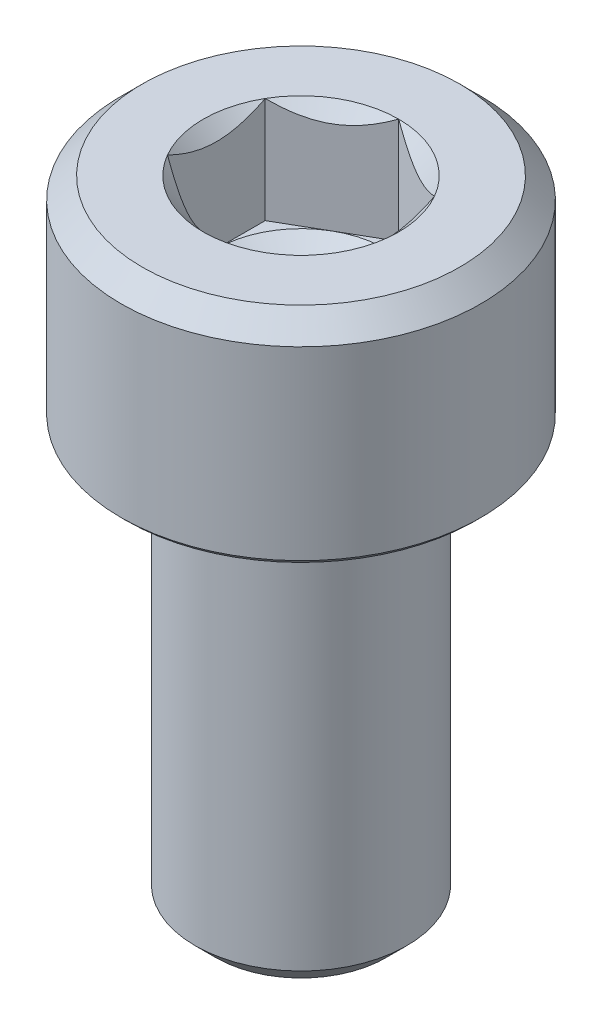
ISO-10303-21;
HEADER;
FILE_DESCRIPTION(('STEP AP214'),'2;1');
FILE_NAME('part.step','',(''),(''),'','','');
FILE_SCHEMA(('AUTOMOTIVE_DESIGN { 1 0 10303 214 1 1 1 1 }'));
ENDSEC;
DATA;
#1=APPLICATION_CONTEXT('core data for automotive mechanical design processes');
#2=APPLICATION_PROTOCOL_DEFINITION('international standard','automotive_design',2000,#1);
#3=PRODUCT_CONTEXT('',#1,'mechanical');
#4=PRODUCT('Part','Part','',(#3));
#5=PRODUCT_RELATED_PRODUCT_CATEGORY('part','',(#4));
#6=PRODUCT_DEFINITION_FORMATION('','',#4);
#7=PRODUCT_DEFINITION_CONTEXT('part definition',#1,'design');
#8=PRODUCT_DEFINITION('design','',#6,#7);
#9=PRODUCT_DEFINITION_SHAPE('','',#8);
#10=(LENGTH_UNIT() NAMED_UNIT(*) SI_UNIT(.MILLI.,.METRE.));
#11=(NAMED_UNIT(*) PLANE_ANGLE_UNIT() SI_UNIT($,.RADIAN.));
#12=(NAMED_UNIT(*) SI_UNIT($,.STERADIAN.) SOLID_ANGLE_UNIT());
#13=UNCERTAINTY_MEASURE_WITH_UNIT(LENGTH_MEASURE(1.E-05),#10,'distance_accuracy_value','');
#14=(GEOMETRIC_REPRESENTATION_CONTEXT(3) GLOBAL_UNCERTAINTY_ASSIGNED_CONTEXT((#13)) GLOBAL_UNIT_ASSIGNED_CONTEXT((#10,
#11,#12)) REPRESENTATION_CONTEXT('',''));
#15=CARTESIAN_POINT('',(0.,0.,0.));
#16=DIRECTION('',(0.,0.,1.));
#17=DIRECTION('',(1.,0.,0.));
#18=AXIS2_PLACEMENT_3D('',#15,#16,#17);
#19=CARTESIAN_POINT('',(0.,5.,0.));
#20=DIRECTION('',(0.,1.,0.));
#21=DIRECTION('',(0.,0.,1.));
#22=AXIS2_PLACEMENT_3D('',#19,#20,#21);
#23=CONICAL_SURFACE('',#22,2.3094010767585,0.785398163397448);
#24=CARTESIAN_POINT('',(0.,5.,0.));
#25=DIRECTION('',(0.,1.,0.));
#26=DIRECTION('',(0.,0.,1.));
#27=AXIS2_PLACEMENT_3D('',#24,#25,#26);
#28=CIRCLE('',#27,2.3094010767585);
#29=CARTESIAN_POINT('',(-2.,5.,-1.1547005383793));
#30=VERTEX_POINT('',#29);
#31=CARTESIAN_POINT('',(-1.99999999999995,5.,1.15470053837933));
#32=VERTEX_POINT('',#31);
#33=EDGE_CURVE('E248',#30,#32,#28,.T.);
#34=ORIENTED_EDGE('',*,*,#33,.T.);
#35=CARTESIAN_POINT('',(-2.,6.70865499521102,3.48493537924179));
#36=CARTESIAN_POINT('',(-2.,6.61927874799564,3.38184597960108));
#37=CARTESIAN_POINT('',(-2.,6.53042050100163,3.27829801866237));
#38=CARTESIAN_POINT('',(-2.,6.35410938767825,3.06992943838188));
#39=CARTESIAN_POINT('',(-2.,6.26665721016999,2.96510823693146));
#40=CARTESIAN_POINT('',(-2.,6.09162252246029,2.75150553836106));
#41=CARTESIAN_POINT('',(-2.,6.00408331853337,2.64268841410052));
#42=CARTESIAN_POINT('',(-2.,5.83166422486035,2.42300125193061));
#43=CARTESIAN_POINT('',(-2.,5.746783673999,2.31213173546715));
#44=CARTESIAN_POINT('',(-2.,5.5805775267781,2.08751128165372));
#45=CARTESIAN_POINT('',(-2.,5.49925685260333,1.9737566780864));
#46=CARTESIAN_POINT('',(-2.,5.3418466932661,1.74250088545252));
#47=CARTESIAN_POINT('',(-2.,5.26576149836546,1.62499673652242));
#48=CARTESIAN_POINT('',(-2.,5.12208771836079,1.38607583721065));
#49=CARTESIAN_POINT('',(-2.,5.05443808556478,1.26469628611466));
#50=CARTESIAN_POINT('',(-2.,4.93125075275313,1.01594779490903));
#51=CARTESIAN_POINT('',(-2.,4.87569076817091,0.888590409780976));
#52=CARTESIAN_POINT('',(-2.,4.80571297250021,0.691083080219591));
#53=CARTESIAN_POINT('',(-2.,4.78445360220782,0.623368585918453));
#54=CARTESIAN_POINT('',(-2.,4.74782417137952,0.486345144048279));
#55=CARTESIAN_POINT('',(-2.,4.73245317082739,0.417036452850217));
#56=CARTESIAN_POINT('',(-2.,4.70862178314111,0.277659447369586));
#57=CARTESIAN_POINT('',(-2.,4.70011930731512,0.20759846696632));
#58=CARTESIAN_POINT('',(-2.,4.69049074221896,0.0669670350324248));
#59=CARTESIAN_POINT('',(-2.,4.68936387797233,-0.00360336219224751));
#60=CARTESIAN_POINT('',(-2.,4.69457684389318,-0.144553783114235));
#61=CARTESIAN_POINT('',(-2.,4.70092642398598,-0.214933437991851));
#62=CARTESIAN_POINT('',(-2.,4.72062790275545,-0.354698452121271));
#63=CARTESIAN_POINT('',(-2.,4.73398118039419,-0.424083612801723));
#64=CARTESIAN_POINT('',(-2.,4.76693306790517,-0.561849214257637));
#65=CARTESIAN_POINT('',(-2.,4.78657533412025,-0.630219027882856));
#66=CARTESIAN_POINT('',(-2.,4.83104362393444,-0.765224928840611));
#67=CARTESIAN_POINT('',(-2.,4.85586970498649,-0.831860996948595));
#68=CARTESIAN_POINT('',(-2.,4.9157973367452,-0.978223263821316));
#69=CARTESIAN_POINT('',(-2.,4.95195365366888,-1.05751393733748));
#70=CARTESIAN_POINT('',(-2.,5.02908857554942,-1.21373425446365));
#71=CARTESIAN_POINT('',(-2.,5.07006996654333,-1.29066250134971));
#72=CARTESIAN_POINT('',(-2.,5.15578343078957,-1.44259332598887));
#73=CARTESIAN_POINT('',(-2.,5.20052309801055,-1.5175915844313));
#74=CARTESIAN_POINT('',(-2.,5.29281710332296,-1.66580274517417));
#75=CARTESIAN_POINT('',(-2.,5.34037088158696,-1.73901599851131));
#76=CARTESIAN_POINT('',(-2.,5.43793273052153,-1.88434580060762));
#77=CARTESIAN_POINT('',(-2.,5.48795248279128,-1.95645447101693));
#78=CARTESIAN_POINT('',(-2.,5.58974868867918,-2.09942399496143));
#79=CARTESIAN_POINT('',(-2.,5.64152527469534,-2.17028475383782));
#80=CARTESIAN_POINT('',(-2.,5.79881562893291,-2.38113790846113));
#81=CARTESIAN_POINT('',(-2.,5.90641011816344,-2.51957625011756));
#82=CARTESIAN_POINT('',(-2.,6.12880481407575,-2.79793708137359));
#83=CARTESIAN_POINT('',(-2.,6.24372553752219,-2.93776233320853));
#84=CARTESIAN_POINT('',(-2.,6.41751226157032,-3.14503859467233));
#85=CARTESIAN_POINT('',(-2.,6.47535435122023,-3.21335225569827));
#86=CARTESIAN_POINT('',(-2.,6.59160375586806,-3.34949093797163));
#87=CARTESIAN_POINT('',(-2.,6.65001104087956,-3.41731598481302));
#88=CARTESIAN_POINT('',(-2.,6.70865499521102,-3.48493537924179));
#89=B_SPLINE_CURVE_WITH_KNOTS('',3,(#35,#36,#37,#38,#39,#40,#41,#42,#43,#44,#45,#46,#47,#48,#49,
#50,#51,#52,#53,#54,#55,#56,#57,#58,#59,#60,#61,#62,#63,#64,#65,#66,#67,#68,#69,#70,#71,#72,#73,
#74,#75,#76,#77,#78,#79,#80,#81,#82,#83,#84,#85,#86,#87,#88),.UNSPECIFIED.,.F.,.F.,(4,2,2,2,2,2,
2,2,2,2,2,2,2,2,2,2,2,2,2,2,2,2,2,2,2,2,4),(0.,0.409325277655497,0.818845319083795,
1.23778871017889,1.65662708384644,2.0760273801686,2.49576736290814,2.91226761680365,
3.32799351692012,3.5407009992713,3.75337451094885,3.96473470800346,4.17607269648515,
4.38768659336546,4.59934217067775,4.81250006998805,5.02566033188271,5.28687426785383,
5.54823977746824,5.81014672661796,6.07200174711865,6.33524589307937,6.59850992182937,
7.12440155307786,7.6673318711903,7.9358664347927,8.20438682857144),.UNSPECIFIED.);
#90=EDGE_CURVE('E135',#32,#30,#89,.T.);
#91=ORIENTED_EDGE('',*,*,#90,.T.);
#92=EDGE_LOOP('',(#34,#91));
#93=FACE_BOUND('',#92,.T.);
#94=ADVANCED_FACE('F43',(#93),#23,.F.);
#95=CARTESIAN_POINT('',(0.,5.,-2.3094010767585));
#96=VERTEX_POINT('',#95);
#97=EDGE_CURVE('E250',#96,#30,#28,.T.);
#98=ORIENTED_EDGE('',*,*,#97,.T.);
#99=CARTESIAN_POINT('',(-2.0002,5.00011547871369,-1.15458506832546));
#100=CARTESIAN_POINT('',(-1.93144696596929,4.96045309022562,-1.19427965103069));
#101=CARTESIAN_POINT('',(-1.86154425786449,4.92311998228419,-1.23463799837209));
#102=CARTESIAN_POINT('',(-1.71900475544956,4.85476368513617,-1.3169332184615));
#103=CARTESIAN_POINT('',(-1.64635440243463,4.82377853373724,-1.35887791933138));
#104=CARTESIAN_POINT('',(-1.49985839894602,4.77070021654416,-1.44345742638073));
#105=CARTESIAN_POINT('',(-1.42605006475369,4.74847362717663,-1.48607068799511));
#106=CARTESIAN_POINT('',(-1.27680836816472,4.7142288166751,-1.57223542169507));
#107=CARTESIAN_POINT('',(-1.20137956608183,4.70218502914416,-1.61578426088227));
#108=CARTESIAN_POINT('',(-1.0713844993289,4.69131851190559,-1.69083694766539));
#109=CARTESIAN_POINT('',(-1.01698621602987,4.68970975360999,-1.72224381117154));
#110=CARTESIAN_POINT('',(-0.908278544480283,4.69241887759873,-1.78500621460367));
#111=CARTESIAN_POINT('',(-0.853969194078636,4.69673883775799,-1.81636173267757));
#112=CARTESIAN_POINT('',(-0.745863272410636,4.71105956740993,-1.87877671565358));
#113=CARTESIAN_POINT('',(-0.692067343445181,4.72106669276203,-1.90983580972309));
#114=CARTESIAN_POINT('',(-0.585405737694398,4.74621243024968,-1.9714169165155));
#115=CARTESIAN_POINT('',(-0.532539989929258,4.76135064904226,-2.00193897021862));
#116=CARTESIAN_POINT('',(-0.397120266910131,4.80629450342921,-2.08012358375729));
#117=CARTESIAN_POINT('',(-0.315406165150502,4.83948883942583,-2.1273012424048));
#118=CARTESIAN_POINT('',(-0.195252962742186,4.89552582317138,-2.19667172615923));
#119=CARTESIAN_POINT('',(-0.155657147890813,4.91521470294695,-2.21953238052245));
#120=CARTESIAN_POINT('',(-0.0771990411121228,4.95638731836488,-2.26483018959124));
#121=CARTESIAN_POINT('',(-0.0383363164062572,4.97786995165125,-2.28726759416161));
#122=CARTESIAN_POINT('',(0.000200000000000131,5.00011547871366,-2.30951654681234));
#123=B_SPLINE_CURVE_WITH_KNOTS('',3,(#99,#100,#101,#102,#103,#104,#105,#106,#107,#108,#109,#110,
#111,#112,#113,#114,#115,#116,#117,#118,#119,#120,#121,#122),.UNSPECIFIED.,.F.,.F.,(4,2,2,2,2,2,
2,2,2,2,2,4),(0.,0.266420613771067,0.534393751523395,0.798110374376924,1.06116288956938,
1.24939906803723,1.43770123566249,1.62621426093933,1.81471283831915,2.11415604834144,
2.26347170717789,2.41269626969768),.UNSPECIFIED.);
#124=EDGE_CURVE('E210',#30,#96,#123,.T.);
#125=ORIENTED_EDGE('',*,*,#124,.T.);
#126=EDGE_LOOP('',(#98,#125));
#127=FACE_BOUND('',#126,.T.);
#128=ADVANCED_FACE('F294',(#127),#23,.F.);
#129=CARTESIAN_POINT('',(2.,5.,-1.1547005383793));
#130=VERTEX_POINT('',#129);
#131=EDGE_CURVE('E247',#130,#96,#28,.T.);
#132=ORIENTED_EDGE('',*,*,#131,.T.);
#133=CARTESIAN_POINT('',(-0.0002,5.00011547871366,-2.30951654681234));
#134=CARTESIAN_POINT('',(0.0685530340307041,4.96045309022559,-2.26982196410711));
#135=CARTESIAN_POINT('',(0.138455742135509,4.92311998228417,-2.22946361676572));
#136=CARTESIAN_POINT('',(0.280995244550431,4.85476368513615,-2.14716839667631));
#137=CARTESIAN_POINT('',(0.353645597565351,4.82377853373723,-2.10522369580643));
#138=CARTESIAN_POINT('',(0.50014160105396,4.77070021654416,-2.02064418875708));
#139=CARTESIAN_POINT('',(0.573949935246281,4.74847362717663,-1.97803092714271));
#140=CARTESIAN_POINT('',(0.723191631835247,4.7142288166751,-1.89186619344275));
#141=CARTESIAN_POINT('',(0.798620433918133,4.70218502914416,-1.84831735425555));
#142=CARTESIAN_POINT('',(0.92861550067106,4.69131851190559,-1.77326466747243));
#143=CARTESIAN_POINT('',(0.98301378397009,4.68970975360999,-1.74185780396628));
#144=CARTESIAN_POINT('',(1.09172145551968,4.69241887759873,-1.67909540053415));
#145=CARTESIAN_POINT('',(1.14603080592132,4.696738837758,-1.64773988246025));
#146=CARTESIAN_POINT('',(1.25413672758932,4.71105956740993,-1.58532489948424));
#147=CARTESIAN_POINT('',(1.30793265655478,4.72106669276203,-1.55426580541473));
#148=CARTESIAN_POINT('',(1.41459426230556,4.74621243024968,-1.49268469862232));
#149=CARTESIAN_POINT('',(1.4674600100707,4.76135064904226,-1.46216264491921));
#150=CARTESIAN_POINT('',(1.60287973308984,4.80629450342921,-1.38397803138053));
#151=CARTESIAN_POINT('',(1.68459383484947,4.83948883942584,-1.33680037273302));
#152=CARTESIAN_POINT('',(1.8047470372578,4.8955258231714,-1.26742988897858));
#153=CARTESIAN_POINT('',(1.84434285210917,4.91521470294697,-1.24456923461535));
#154=CARTESIAN_POINT('',(1.92280095888787,4.9563873183649,-1.19927142554657));
#155=CARTESIAN_POINT('',(1.96166368359374,4.97786995165127,-1.17683402097619));
#156=CARTESIAN_POINT('',(2.0002,5.00011547871369,-1.15458506832546));
#157=B_SPLINE_CURVE_WITH_KNOTS('',3,(#133,#134,#135,#136,#137,#138,#139,#140,#141,#142,#143,
#144,#145,#146,#147,#148,#149,#150,#151,#152,#153,#154,#155,#156),.UNSPECIFIED.,.F.,.F.,(4,2,2,
2,2,2,2,2,2,2,2,4),(0.,0.266420613771054,0.534393751523368,0.798110374376884,1.06116288956932,
1.24939906803718,1.43770123566244,1.62621426093928,1.81471283831909,2.11415604834141,
2.26347170717787,2.41269626969768),.UNSPECIFIED.);
#158=EDGE_CURVE('E261',#96,#130,#157,.T.);
#159=ORIENTED_EDGE('',*,*,#158,.T.);
#160=EDGE_LOOP('',(#132,#159));
#161=FACE_BOUND('',#160,.T.);
#162=ADVANCED_FACE('F259',(#161),#23,.F.);
#163=CARTESIAN_POINT('',(2.,5.,1.1547005383793));
#164=VERTEX_POINT('',#163);
#165=EDGE_CURVE('E242',#164,#130,#28,.T.);
#166=ORIENTED_EDGE('',*,*,#165,.T.);
#167=CARTESIAN_POINT('',(2.,6.70865499521102,-3.48493537924179));
#168=CARTESIAN_POINT('',(2.,6.61927874799564,-3.38184597960108));
#169=CARTESIAN_POINT('',(2.,6.53042050100163,-3.27829801866237));
#170=CARTESIAN_POINT('',(2.,6.35410938767825,-3.06992943838188));
#171=CARTESIAN_POINT('',(2.,6.26665721016999,-2.96510823693146));
#172=CARTESIAN_POINT('',(2.,6.09162252246029,-2.75150553836106));
#173=CARTESIAN_POINT('',(2.,6.00408331853337,-2.64268841410052));
#174=CARTESIAN_POINT('',(2.,5.83166422486035,-2.42300125193061));
#175=CARTESIAN_POINT('',(2.,5.746783673999,-2.31213173546715));
#176=CARTESIAN_POINT('',(2.,5.5805775267781,-2.08751128165372));
#177=CARTESIAN_POINT('',(2.,5.49925685260333,-1.9737566780864));
#178=CARTESIAN_POINT('',(2.,5.3418466932661,-1.74250088545252));
#179=CARTESIAN_POINT('',(2.,5.26576149836546,-1.62499673652242));
#180=CARTESIAN_POINT('',(2.,5.12208771836079,-1.38607583721065));
#181=CARTESIAN_POINT('',(2.,5.05443808556478,-1.26469628611466));
#182=CARTESIAN_POINT('',(2.,4.93125075275313,-1.01594779490903));
#183=CARTESIAN_POINT('',(2.,4.87569076817091,-0.888590409780976));
#184=CARTESIAN_POINT('',(2.,4.80571297250021,-0.691083080219591));
#185=CARTESIAN_POINT('',(2.,4.78445360220782,-0.623368585918453));
#186=CARTESIAN_POINT('',(2.,4.74782417137952,-0.486345144048279));
#187=CARTESIAN_POINT('',(2.,4.73245317082739,-0.417036452850217));
#188=CARTESIAN_POINT('',(2.,4.70862178314111,-0.277659447369586));
#189=CARTESIAN_POINT('',(2.,4.70011930731512,-0.20759846696632));
#190=CARTESIAN_POINT('',(2.,4.69049074221896,-0.0669670350324248));
#191=CARTESIAN_POINT('',(2.,4.68936387797233,0.00360336219224751));
#192=CARTESIAN_POINT('',(2.,4.69457684389318,0.144553783114235));
#193=CARTESIAN_POINT('',(2.,4.70092642398598,0.214933437991851));
#194=CARTESIAN_POINT('',(2.,4.72062790275545,0.354698452121271));
#195=CARTESIAN_POINT('',(2.,4.73398118039419,0.424083612801723));
#196=CARTESIAN_POINT('',(2.,4.76693306790517,0.561849214257637));
#197=CARTESIAN_POINT('',(2.,4.78657533412025,0.630219027882856));
#198=CARTESIAN_POINT('',(2.,4.83104362393444,0.765224928840611));
#199=CARTESIAN_POINT('',(2.,4.85586970498649,0.831860996948595));
#200=CARTESIAN_POINT('',(2.,4.9157973367452,0.978223263821316));
#201=CARTESIAN_POINT('',(2.,4.95195365366888,1.05751393733748));
#202=CARTESIAN_POINT('',(2.,5.02908857554942,1.21373425446365));
#203=CARTESIAN_POINT('',(2.,5.07006996654333,1.29066250134971));
#204=CARTESIAN_POINT('',(2.,5.15578343078957,1.44259332598887));
#205=CARTESIAN_POINT('',(2.,5.20052309801055,1.5175915844313));
#206=CARTESIAN_POINT('',(2.,5.29281710332296,1.66580274517417));
#207=CARTESIAN_POINT('',(2.,5.34037088158696,1.73901599851131));
#208=CARTESIAN_POINT('',(2.,5.43793273052153,1.88434580060762));
#209=CARTESIAN_POINT('',(2.,5.48795248279128,1.95645447101693));
#210=CARTESIAN_POINT('',(2.,5.58974868867918,2.09942399496143));
#211=CARTESIAN_POINT('',(2.,5.64152527469534,2.17028475383782));
#212=CARTESIAN_POINT('',(2.,5.79881562893291,2.38113790846113));
#213=CARTESIAN_POINT('',(2.,5.90641011816344,2.51957625011756));
#214=CARTESIAN_POINT('',(2.,6.12880481407575,2.79793708137359));
#215=CARTESIAN_POINT('',(2.,6.24372553752219,2.93776233320853));
#216=CARTESIAN_POINT('',(2.,6.41751226157032,3.14503859467233));
#217=CARTESIAN_POINT('',(2.,6.47535435122023,3.21335225569827));
#218=CARTESIAN_POINT('',(2.,6.59160375586806,3.34949093797163));
#219=CARTESIAN_POINT('',(2.,6.65001104087956,3.41731598481302));
#220=CARTESIAN_POINT('',(2.,6.70865499521102,3.48493537924179));
#221=B_SPLINE_CURVE_WITH_KNOTS('',3,(#167,#168,#169,#170,#171,#172,#173,#174,#175,#176,#177,
#178,#179,#180,#181,#182,#183,#184,#185,#186,#187,#188,#189,#190,#191,#192,#193,#194,#195,#196,
#197,#198,#199,#200,#201,#202,#203,#204,#205,#206,#207,#208,#209,#210,#211,#212,#213,#214,#215,
#216,#217,#218,#219,#220),.UNSPECIFIED.,.F.,.F.,(4,2,2,2,2,2,2,2,2,2,2,2,2,2,2,2,2,2,2,2,2,2,2,
2,2,2,4),(0.,0.409325277655497,0.818845319083795,1.23778871017889,1.65662708384644,
2.0760273801686,2.49576736290814,2.91226761680365,3.32799351692012,3.5407009992713,
3.75337451094885,3.96473470800346,4.17607269648515,4.38768659336546,4.59934217067775,
4.81250006998805,5.02566033188271,5.28687426785383,5.54823977746824,5.81014672661796,
6.07200174711865,6.33524589307937,6.59850992182937,7.12440155307786,7.6673318711903,
7.9358664347927,8.20438682857144),.UNSPECIFIED.);
#222=EDGE_CURVE('E269',#130,#164,#221,.T.);
#223=ORIENTED_EDGE('',*,*,#222,.T.);
#224=EDGE_LOOP('',(#166,#223));
#225=FACE_BOUND('',#224,.T.);
#226=ADVANCED_FACE('F268',(#225),#23,.F.);
#227=CARTESIAN_POINT('',(0.,5.,2.3094010767585));
#228=VERTEX_POINT('',#227);
#229=EDGE_CURVE('E240',#228,#164,#28,.T.);
#230=ORIENTED_EDGE('',*,*,#229,.T.);
#231=CARTESIAN_POINT('',(2.0002,5.00011547871369,1.15458506832546));
#232=CARTESIAN_POINT('',(1.93144696596929,4.96045309022562,1.19427965103069));
#233=CARTESIAN_POINT('',(1.86154425786449,4.92311998228419,1.23463799837209));
#234=CARTESIAN_POINT('',(1.71900475544956,4.85476368513617,1.3169332184615));
#235=CARTESIAN_POINT('',(1.64635440243463,4.82377853373724,1.35887791933138));
#236=CARTESIAN_POINT('',(1.49985839894602,4.77070021654416,1.44345742638073));
#237=CARTESIAN_POINT('',(1.42605006475369,4.74847362717663,1.48607068799511));
#238=CARTESIAN_POINT('',(1.27680836816472,4.7142288166751,1.57223542169507));
#239=CARTESIAN_POINT('',(1.20137956608183,4.70218502914416,1.61578426088227));
#240=CARTESIAN_POINT('',(1.0713844993289,4.69131851190559,1.69083694766539));
#241=CARTESIAN_POINT('',(1.01698621602987,4.68970975360999,1.72224381117154));
#242=CARTESIAN_POINT('',(0.908278544480283,4.69241887759873,1.78500621460367));
#243=CARTESIAN_POINT('',(0.853969194078636,4.69673883775799,1.81636173267757));
#244=CARTESIAN_POINT('',(0.745863272410636,4.71105956740993,1.87877671565358));
#245=CARTESIAN_POINT('',(0.692067343445181,4.72106669276203,1.90983580972309));
#246=CARTESIAN_POINT('',(0.585405737694398,4.74621243024968,1.9714169165155));
#247=CARTESIAN_POINT('',(0.532539989929258,4.76135064904226,2.00193897021862));
#248=CARTESIAN_POINT('',(0.397120266910131,4.80629450342921,2.08012358375729));
#249=CARTESIAN_POINT('',(0.315406165150502,4.83948883942583,2.1273012424048));
#250=CARTESIAN_POINT('',(0.195252962742186,4.89552582317138,2.19667172615923));
#251=CARTESIAN_POINT('',(0.155657147890813,4.91521470294695,2.21953238052245));
#252=CARTESIAN_POINT('',(0.0771990411121228,4.95638731836488,2.26483018959124));
#253=CARTESIAN_POINT('',(0.0383363164062572,4.97786995165125,2.28726759416161));
#254=CARTESIAN_POINT('',(-0.000200000000000131,5.00011547871366,2.30951654681234));
#255=B_SPLINE_CURVE_WITH_KNOTS('',3,(#231,#232,#233,#234,#235,#236,#237,#238,#239,#240,#241,
#242,#243,#244,#245,#246,#247,#248,#249,#250,#251,#252,#253,#254),.UNSPECIFIED.,.F.,.F.,(4,2,2,
2,2,2,2,2,2,2,2,4),(0.,0.266420613771067,0.534393751523395,0.798110374376924,1.06116288956938,
1.24939906803723,1.43770123566249,1.62621426093933,1.81471283831915,2.11415604834144,
2.26347170717789,2.41269626969768),.UNSPECIFIED.);
#256=EDGE_CURVE('E179',#164,#228,#255,.T.);
#257=ORIENTED_EDGE('',*,*,#256,.T.);
#258=EDGE_LOOP('',(#230,#257));
#259=FACE_BOUND('',#258,.T.);
#260=ADVANCED_FACE('F299',(#259),#23,.F.);
#261=EDGE_CURVE('E239',#32,#228,#28,.T.);
#262=ORIENTED_EDGE('',*,*,#261,.T.);
#263=CARTESIAN_POINT('',(0.0002,5.00011547871366,2.30951654681234));
#264=CARTESIAN_POINT('',(-0.0685530340307041,4.96045309022559,2.26982196410711));
#265=CARTESIAN_POINT('',(-0.138455742135509,4.92311998228417,2.22946361676572));
#266=CARTESIAN_POINT('',(-0.280995244550431,4.85476368513615,2.14716839667631));
#267=CARTESIAN_POINT('',(-0.353645597565351,4.82377853373723,2.10522369580643));
#268=CARTESIAN_POINT('',(-0.50014160105396,4.77070021654416,2.02064418875708));
#269=CARTESIAN_POINT('',(-0.573949935246281,4.74847362717663,1.97803092714271));
#270=CARTESIAN_POINT('',(-0.723191631835247,4.7142288166751,1.89186619344275));
#271=CARTESIAN_POINT('',(-0.798620433918133,4.70218502914416,1.84831735425555));
#272=CARTESIAN_POINT('',(-0.92861550067106,4.69131851190559,1.77326466747243));
#273=CARTESIAN_POINT('',(-0.98301378397009,4.68970975360999,1.74185780396628));
#274=CARTESIAN_POINT('',(-1.09172145551968,4.69241887759873,1.67909540053415));
#275=CARTESIAN_POINT('',(-1.14603080592132,4.696738837758,1.64773988246025));
#276=CARTESIAN_POINT('',(-1.25413672758932,4.71105956740993,1.58532489948424));
#277=CARTESIAN_POINT('',(-1.30793265655478,4.72106669276203,1.55426580541473));
#278=CARTESIAN_POINT('',(-1.41459426230556,4.74621243024968,1.49268469862232));
#279=CARTESIAN_POINT('',(-1.4674600100707,4.76135064904226,1.46216264491921));
#280=CARTESIAN_POINT('',(-1.60287973308984,4.80629450342921,1.38397803138053));
#281=CARTESIAN_POINT('',(-1.68459383484947,4.83948883942584,1.33680037273302));
#282=CARTESIAN_POINT('',(-1.8047470372578,4.8955258231714,1.26742988897858));
#283=CARTESIAN_POINT('',(-1.84434285210917,4.91521470294697,1.24456923461535));
#284=CARTESIAN_POINT('',(-1.92280095888787,4.9563873183649,1.19927142554657));
#285=CARTESIAN_POINT('',(-1.96166368359374,4.97786995165127,1.17683402097619));
#286=CARTESIAN_POINT('',(-2.0002,5.00011547871369,1.15458506832546));
#287=B_SPLINE_CURVE_WITH_KNOTS('',3,(#263,#264,#265,#266,#267,#268,#269,#270,#271,#272,#273,
#274,#275,#276,#277,#278,#279,#280,#281,#282,#283,#284,#285,#286),.UNSPECIFIED.,.F.,.F.,(4,2,2,
2,2,2,2,2,2,2,2,4),(0.,0.266420613771054,0.534393751523368,0.798110374376884,1.06116288956932,
1.24939906803718,1.43770123566244,1.62621426093928,1.81471283831909,2.11415604834141,
2.26347170717787,2.41269626969768),.UNSPECIFIED.);
#288=EDGE_CURVE('E66',#228,#32,#287,.T.);
#289=ORIENTED_EDGE('',*,*,#288,.T.);
#290=EDGE_LOOP('',(#262,#289));
#291=FACE_BOUND('',#290,.T.);
#292=ADVANCED_FACE('F186',(#291),#23,.F.);
#293=CARTESIAN_POINT('',(2.3094010767585,5.,0.));
#294=DIRECTION('',(0.,-1.,0.));
#295=DIRECTION('',(0.,0.,-1.));
#296=AXIS2_PLACEMENT_3D('',#293,#294,#295);
#297=PLANE('',#296);
#298=ORIENTED_EDGE('',*,*,#229,.F.);
#299=ORIENTED_EDGE('',*,*,#261,.F.);
#300=ORIENTED_EDGE('',*,*,#33,.F.);
#301=ORIENTED_EDGE('',*,*,#97,.F.);
#302=ORIENTED_EDGE('',*,*,#131,.F.);
#303=ORIENTED_EDGE('',*,*,#165,.F.);
#304=EDGE_LOOP('',(#298,#299,#300,#301,#302,#303));
#305=FACE_BOUND('',#304,.T.);
#306=CARTESIAN_POINT('',(0.,5.,0.));
#307=DIRECTION('',(0.,1.,0.));
#308=DIRECTION('',(0.,0.,1.));
#309=AXIS2_PLACEMENT_3D('',#306,#307,#308);
#310=CIRCLE('',#309,3.75);
#311=CARTESIAN_POINT('',(0.,5.,3.75));
#312=VERTEX_POINT('',#311);
#313=EDGE_CURVE('E237',#312,#312,#310,.T.);
#314=ORIENTED_EDGE('',*,*,#313,.T.);
#315=EDGE_LOOP('',(#314));
#316=FACE_BOUND('',#315,.T.);
#317=ADVANCED_FACE('F265',(#305,#316),#297,.F.);
#318=CARTESIAN_POINT('',(0.,4.5,0.));
#319=DIRECTION('',(0.,-1.,0.));
#320=DIRECTION('',(0.,0.,-1.));
#321=AXIS2_PLACEMENT_3D('',#318,#319,#320);
#322=CONICAL_SURFACE('',#321,4.25,0.78539816339745);
#323=ORIENTED_EDGE('',*,*,#313,.F.);
#324=EDGE_LOOP('',(#323));
#325=FACE_BOUND('',#324,.T.);
#326=CARTESIAN_POINT('',(0.,4.5,0.));
#327=DIRECTION('',(0.,1.,0.));
#328=DIRECTION('',(0.,0.,1.));
#329=AXIS2_PLACEMENT_3D('',#326,#327,#328);
#330=CIRCLE('',#329,4.25);
#331=CARTESIAN_POINT('',(0.,4.5,4.25));
#332=VERTEX_POINT('',#331);
#333=EDGE_CURVE('E234',#332,#332,#330,.T.);
#334=ORIENTED_EDGE('',*,*,#333,.T.);
#335=EDGE_LOOP('',(#334));
#336=FACE_BOUND('',#335,.T.);
#337=ADVANCED_FACE('F304',(#325,#336),#322,.T.);
#338=CARTESIAN_POINT('',(0.,-10.,0.));
#339=DIRECTION('',(0.,1.,0.));
#340=DIRECTION('',(0.,0.,1.));
#341=AXIS2_PLACEMENT_3D('',#338,#339,#340);
#342=CYLINDRICAL_SURFACE('',#341,4.25);
#343=ORIENTED_EDGE('',*,*,#333,.F.);
#344=EDGE_LOOP('',(#343));
#345=FACE_BOUND('',#344,.T.);
#346=CARTESIAN_POINT('',(0.,0.125,0.));
#347=DIRECTION('',(0.,1.,0.));
#348=DIRECTION('',(0.,0.,1.));
#349=AXIS2_PLACEMENT_3D('',#346,#347,#348);
#350=CIRCLE('',#349,4.25);
#351=CARTESIAN_POINT('',(0.,0.125,4.25));
#352=VERTEX_POINT('',#351);
#353=EDGE_CURVE('E231',#352,#352,#350,.T.);
#354=ORIENTED_EDGE('',*,*,#353,.T.);
#355=EDGE_LOOP('',(#354));
#356=FACE_BOUND('',#355,.T.);
#357=ADVANCED_FACE('F382',(#345,#356),#342,.T.);
#358=CARTESIAN_POINT('',(0.,0.,0.));
#359=DIRECTION('',(0.,1.,0.));
#360=DIRECTION('',(0.,0.,1.));
#361=AXIS2_PLACEMENT_3D('',#358,#359,#360);
#362=CONICAL_SURFACE('',#361,4.125,0.785398163397448);
#363=ORIENTED_EDGE('',*,*,#353,.F.);
#364=EDGE_LOOP('',(#363));
#365=FACE_BOUND('',#364,.T.);
#366=CARTESIAN_POINT('',(0.,0.,0.));
#367=DIRECTION('',(0.,1.,0.));
#368=DIRECTION('',(0.,0.,1.));
#369=AXIS2_PLACEMENT_3D('',#366,#367,#368);
#370=CIRCLE('',#369,4.125);
#371=CARTESIAN_POINT('',(0.,0.,4.125));
#372=VERTEX_POINT('',#371);
#373=EDGE_CURVE('E228',#372,#372,#370,.T.);
#374=ORIENTED_EDGE('',*,*,#373,.T.);
#375=EDGE_LOOP('',(#374));
#376=FACE_BOUND('',#375,.T.);
#377=ADVANCED_FACE('F386',(#365,#376),#362,.T.);
#378=CARTESIAN_POINT('',(4.125,0.,0.));
#379=DIRECTION('',(0.,1.,0.));
#380=DIRECTION('',(0.,0.,1.));
#381=AXIS2_PLACEMENT_3D('',#378,#379,#380);
#382=PLANE('',#381);
#383=ORIENTED_EDGE('',*,*,#373,.F.);
#384=EDGE_LOOP('',(#383));
#385=FACE_BOUND('',#384,.T.);
#386=CARTESIAN_POINT('',(0.,0.,0.));
#387=DIRECTION('',(0.,1.,0.));
#388=DIRECTION('',(0.,0.,1.));
#389=AXIS2_PLACEMENT_3D('',#386,#387,#388);
#390=CIRCLE('',#389,2.55);
#391=CARTESIAN_POINT('',(0.,0.,2.55));
#392=VERTEX_POINT('',#391);
#393=EDGE_CURVE('E225',#392,#392,#390,.T.);
#394=ORIENTED_EDGE('',*,*,#393,.T.);
#395=EDGE_LOOP('',(#394));
#396=FACE_BOUND('',#395,.T.);
#397=ADVANCED_FACE('F442',(#385,#396),#382,.F.);
#398=CARTESIAN_POINT('',(0.,-0.6,0.));
#399=DIRECTION('',(0.,1.,0.));
#400=DIRECTION('',(0.,0.,1.));
#401=AXIS2_PLACEMENT_3D('',#398,#399,#400);
#402=CONICAL_SURFACE('',#401,2.5,0.0831412318884407);
#403=ORIENTED_EDGE('',*,*,#393,.F.);
#404=EDGE_LOOP('',(#403));
#405=FACE_BOUND('',#404,.T.);
#406=CARTESIAN_POINT('',(0.,-0.6,0.));
#407=DIRECTION('',(0.,1.,0.));
#408=DIRECTION('',(0.,0.,1.));
#409=AXIS2_PLACEMENT_3D('',#406,#407,#408);
#410=CIRCLE('',#409,2.5);
#411=CARTESIAN_POINT('',(0.,-0.6,2.5));
#412=VERTEX_POINT('',#411);
#413=EDGE_CURVE('E222',#412,#412,#410,.T.);
#414=ORIENTED_EDGE('',*,*,#413,.T.);
#415=EDGE_LOOP('',(#414));
#416=FACE_BOUND('',#415,.T.);
#417=ADVANCED_FACE('F431',(#405,#416),#402,.T.);
#418=CARTESIAN_POINT('',(0.,-10.,0.));
#419=DIRECTION('',(0.,1.,0.));
#420=DIRECTION('',(0.,0.,1.));
#421=AXIS2_PLACEMENT_3D('',#418,#419,#420);
#422=CYLINDRICAL_SURFACE('',#421,2.5);
#423=ORIENTED_EDGE('',*,*,#413,.F.);
#424=EDGE_LOOP('',(#423));
#425=FACE_BOUND('',#424,.T.);
#426=CARTESIAN_POINT('',(0.,-9.5095,0.));
#427=DIRECTION('',(0.,1.,0.));
#428=DIRECTION('',(0.,0.,1.));
#429=AXIS2_PLACEMENT_3D('',#426,#427,#428);
#430=CIRCLE('',#429,2.5);
#431=CARTESIAN_POINT('',(0.,-9.5095,2.5));
#432=VERTEX_POINT('',#431);
#433=EDGE_CURVE('E219',#432,#432,#430,.T.);
#434=ORIENTED_EDGE('',*,*,#433,.T.);
#435=EDGE_LOOP('',(#434));
#436=FACE_BOUND('',#435,.T.);
#437=ADVANCED_FACE('F325',(#425,#436),#422,.T.);
#438=CARTESIAN_POINT('',(0.,-10.,0.));
#439=DIRECTION('',(0.,1.,0.));
#440=DIRECTION('',(0.,0.,1.));
#441=AXIS2_PLACEMENT_3D('',#438,#439,#440);
#442=CONICAL_SURFACE('',#441,2.0095,0.785398163397447);
#443=ORIENTED_EDGE('',*,*,#433,.F.);
#444=EDGE_LOOP('',(#443));
#445=FACE_BOUND('',#444,.T.);
#446=CARTESIAN_POINT('',(0.,-10.,0.));
#447=DIRECTION('',(0.,1.,0.));
#448=DIRECTION('',(0.,0.,1.));
#449=AXIS2_PLACEMENT_3D('',#446,#447,#448);
#450=CIRCLE('',#449,2.0095);
#451=CARTESIAN_POINT('',(0.,-10.,2.0095));
#452=VERTEX_POINT('',#451);
#453=EDGE_CURVE('E209',#452,#452,#450,.T.);
#454=ORIENTED_EDGE('',*,*,#453,.T.);
#455=EDGE_LOOP('',(#454));
#456=FACE_BOUND('',#455,.T.);
#457=ADVANCED_FACE('F408',(#445,#456),#442,.T.);
#458=CARTESIAN_POINT('',(2.0095,-10.,0.));
#459=DIRECTION('',(0.,1.,0.));
#460=DIRECTION('',(0.,0.,1.));
#461=AXIS2_PLACEMENT_3D('',#458,#459,#460);
#462=PLANE('',#461);
#463=ORIENTED_EDGE('',*,*,#453,.F.);
#464=EDGE_LOOP('',(#463));
#465=FACE_BOUND('',#464,.T.);
#466=ADVANCED_FACE('F200',(#465),#462,.F.);
#467=CARTESIAN_POINT('',(0.,2.5,0.));
#468=DIRECTION('',(0.,1.,0.));
#469=DIRECTION('',(0.,0.,1.));
#470=AXIS2_PLACEMENT_3D('',#467,#468,#469);
#471=PLANE('',#470);
#472=CARTESIAN_POINT('',(0.,2.5,0.));
#473=DIRECTION('',(0.,1.,0.));
#474=DIRECTION('',(0.,0.,1.));
#475=AXIS2_PLACEMENT_3D('',#472,#473,#474);
#476=CIRCLE('',#475,2.);
#477=CARTESIAN_POINT('',(-2.,2.5,0.));
#478=VERTEX_POINT('',#477);
#479=CARTESIAN_POINT('',(-0.999999999999976,2.5,1.73205080756891));
#480=VERTEX_POINT('',#479);
#481=EDGE_CURVE('E125',#478,#480,#476,.T.);
#482=ORIENTED_EDGE('',*,*,#481,.F.);
#483=DIRECTION('',(0.,0.,1.));
#484=VECTOR('',#483,1.);
#485=CARTESIAN_POINT('',(-2.,2.5,-1.1547005383793));
#486=LINE('',#485,#484);
#487=CARTESIAN_POINT('',(-2.,2.5,1.1547005383793));
#488=VERTEX_POINT('',#487);
#489=EDGE_CURVE('E119',#478,#488,#486,.T.);
#490=ORIENTED_EDGE('',*,*,#489,.T.);
#491=DIRECTION('',(0.866025403784448,0.,0.499999999999983));
#492=VECTOR('',#491,1.);
#493=CARTESIAN_POINT('',(-2.,2.5,1.1547005383793));
#494=LINE('',#493,#492);
#495=EDGE_CURVE('E123',#488,#480,#494,.T.);
#496=ORIENTED_EDGE('',*,*,#495,.T.);
#497=EDGE_LOOP('',(#482,#490,#496));
#498=FACE_BOUND('',#497,.T.);
#499=ADVANCED_FACE('F121',(#498),#471,.T.);
#500=CARTESIAN_POINT('',(-0.999999999999976,2.5,-1.73205080756891));
#501=VERTEX_POINT('',#500);
#502=EDGE_CURVE('E532',#501,#478,#476,.T.);
#503=ORIENTED_EDGE('',*,*,#502,.F.);
#504=DIRECTION('',(-0.866025403784448,0.,0.499999999999983));
#505=VECTOR('',#504,1.);
#506=CARTESIAN_POINT('',(0.,2.5,-2.3094010767585));
#507=LINE('',#506,#505);
#508=CARTESIAN_POINT('',(-2.,2.5,-1.1547005383793));
#509=VERTEX_POINT('',#508);
#510=EDGE_CURVE('E157',#501,#509,#507,.T.);
#511=ORIENTED_EDGE('',*,*,#510,.T.);
#512=EDGE_CURVE('E129',#509,#478,#486,.T.);
#513=ORIENTED_EDGE('',*,*,#512,.T.);
#514=EDGE_LOOP('',(#503,#511,#513));
#515=FACE_BOUND('',#514,.T.);
#516=ADVANCED_FACE('F292',(#515),#471,.T.);
#517=CARTESIAN_POINT('',(0.999999999999976,2.5,-1.73205080756891));
#518=VERTEX_POINT('',#517);
#519=EDGE_CURVE('E531',#518,#501,#476,.T.);
#520=ORIENTED_EDGE('',*,*,#519,.F.);
#521=DIRECTION('',(-0.866025403784448,0.,-0.499999999999983));
#522=VECTOR('',#521,1.);
#523=CARTESIAN_POINT('',(2.,2.5,-1.1547005383793));
#524=LINE('',#523,#522);
#525=CARTESIAN_POINT('',(0.,2.5,-2.3094010767585));
#526=VERTEX_POINT('',#525);
#527=EDGE_CURVE('E153',#518,#526,#524,.T.);
#528=ORIENTED_EDGE('',*,*,#527,.T.);
#529=EDGE_CURVE('E139',#526,#501,#507,.T.);
#530=ORIENTED_EDGE('',*,*,#529,.T.);
#531=EDGE_LOOP('',(#520,#528,#530));
#532=FACE_BOUND('',#531,.T.);
#533=ADVANCED_FACE('F476',(#532),#471,.T.);
#534=CARTESIAN_POINT('',(2.,2.5,0.));
#535=VERTEX_POINT('',#534);
#536=EDGE_CURVE('E51',#535,#518,#476,.T.);
#537=ORIENTED_EDGE('',*,*,#536,.F.);
#538=DIRECTION('',(0.,0.,-1.));
#539=VECTOR('',#538,1.);
#540=CARTESIAN_POINT('',(2.,2.5,1.1547005383793));
#541=LINE('',#540,#539);
#542=CARTESIAN_POINT('',(2.,2.5,-1.1547005383793));
#543=VERTEX_POINT('',#542);
#544=EDGE_CURVE('E149',#535,#543,#541,.T.);
#545=ORIENTED_EDGE('',*,*,#544,.T.);
#546=EDGE_CURVE('E154',#543,#518,#524,.T.);
#547=ORIENTED_EDGE('',*,*,#546,.T.);
#548=EDGE_LOOP('',(#537,#545,#547));
#549=FACE_BOUND('',#548,.T.);
#550=ADVANCED_FACE('F290',(#549),#471,.T.);
#551=CARTESIAN_POINT('',(0.999999999999966,2.5,1.7320508075689));
#552=VERTEX_POINT('',#551);
#553=EDGE_CURVE('E11',#552,#535,#476,.T.);
#554=ORIENTED_EDGE('',*,*,#553,.F.);
#555=DIRECTION('',(0.866025403784448,0.,-0.499999999999983));
#556=VECTOR('',#555,1.);
#557=CARTESIAN_POINT('',(0.,2.5,2.3094010767585));
#558=LINE('',#557,#556);
#559=CARTESIAN_POINT('',(2.,2.5,1.1547005383793));
#560=VERTEX_POINT('',#559);
#561=EDGE_CURVE('E145',#552,#560,#558,.T.);
#562=ORIENTED_EDGE('',*,*,#561,.T.);
#563=EDGE_CURVE('E150',#560,#535,#541,.T.);
#564=ORIENTED_EDGE('',*,*,#563,.T.);
#565=EDGE_LOOP('',(#554,#562,#564));
#566=FACE_BOUND('',#565,.T.);
#567=ADVANCED_FACE('F280',(#566),#471,.T.);
#568=EDGE_CURVE('E52',#480,#552,#476,.T.);
#569=ORIENTED_EDGE('',*,*,#568,.F.);
#570=CARTESIAN_POINT('',(0.,2.5,2.3094010767585));
#571=VERTEX_POINT('',#570);
#572=EDGE_CURVE('E144',#480,#571,#494,.T.);
#573=ORIENTED_EDGE('',*,*,#572,.T.);
#574=EDGE_CURVE('E59',#571,#552,#558,.T.);
#575=ORIENTED_EDGE('',*,*,#574,.T.);
#576=EDGE_LOOP('',(#569,#573,#575));
#577=FACE_BOUND('',#576,.T.);
#578=ADVANCED_FACE('F199',(#577),#471,.T.);
#579=CARTESIAN_POINT('',(-2.,2.5,-1.1547005383793));
#580=DIRECTION('',(-1.,0.,0.));
#581=DIRECTION('',(0.,0.,1.));
#582=AXIS2_PLACEMENT_3D('',#579,#580,#581);
#583=PLANE('',#582);
#584=ORIENTED_EDGE('',*,*,#90,.F.);
#585=DIRECTION('',(0.,1.,0.));
#586=VECTOR('',#585,1.);
#587=CARTESIAN_POINT('',(-2.,2.5,1.1547005383793));
#588=LINE('',#587,#586);
#589=EDGE_CURVE('E132',#488,#32,#588,.T.);
#590=ORIENTED_EDGE('',*,*,#589,.F.);
#591=ORIENTED_EDGE('',*,*,#489,.F.);
#592=ORIENTED_EDGE('',*,*,#512,.F.);
#593=DIRECTION('',(0.,1.,0.));
#594=VECTOR('',#593,1.);
#595=CARTESIAN_POINT('',(-2.,2.5,-1.1547005383793));
#596=LINE('',#595,#594);
#597=EDGE_CURVE('E160',#509,#30,#596,.T.);
#598=ORIENTED_EDGE('',*,*,#597,.T.);
#599=EDGE_LOOP('',(#584,#590,#591,#592,#598));
#600=FACE_BOUND('',#599,.T.);
#601=ADVANCED_FACE('F133',(#600),#583,.F.);
#602=CARTESIAN_POINT('',(0.,2.5,-2.3094010767585));
#603=DIRECTION('',(-0.499999999999983,0.,-0.866025403784448));
#604=DIRECTION('',(-0.866025403784448,0.,0.499999999999983));
#605=AXIS2_PLACEMENT_3D('',#602,#603,#604);
#606=PLANE('',#605);
#607=ORIENTED_EDGE('',*,*,#124,.F.);
#608=ORIENTED_EDGE('',*,*,#597,.F.);
#609=ORIENTED_EDGE('',*,*,#510,.F.);
#610=ORIENTED_EDGE('',*,*,#529,.F.);
#611=DIRECTION('',(0.,1.,0.));
#612=VECTOR('',#611,1.);
#613=CARTESIAN_POINT('',(0.,2.5,-2.3094010767585));
#614=LINE('',#613,#612);
#615=EDGE_CURVE('E162',#526,#96,#614,.T.);
#616=ORIENTED_EDGE('',*,*,#615,.T.);
#617=EDGE_LOOP('',(#607,#608,#609,#610,#616));
#618=FACE_BOUND('',#617,.T.);
#619=ADVANCED_FACE('F198',(#618),#606,.F.);
#620=CARTESIAN_POINT('',(2.,2.5,-1.1547005383793));
#621=DIRECTION('',(0.499999999999983,0.,-0.866025403784448));
#622=DIRECTION('',(-0.866025403784448,0.,-0.499999999999983));
#623=AXIS2_PLACEMENT_3D('',#620,#621,#622);
#624=PLANE('',#623);
#625=ORIENTED_EDGE('',*,*,#158,.F.);
#626=ORIENTED_EDGE('',*,*,#615,.F.);
#627=ORIENTED_EDGE('',*,*,#527,.F.);
#628=ORIENTED_EDGE('',*,*,#546,.F.);
#629=DIRECTION('',(0.,1.,0.));
#630=VECTOR('',#629,1.);
#631=CARTESIAN_POINT('',(2.,2.5,-1.1547005383793));
#632=LINE('',#631,#630);
#633=EDGE_CURVE('E165',#543,#130,#632,.T.);
#634=ORIENTED_EDGE('',*,*,#633,.T.);
#635=EDGE_LOOP('',(#625,#626,#627,#628,#634));
#636=FACE_BOUND('',#635,.T.);
#637=ADVANCED_FACE('F332',(#636),#624,.F.);
#638=CARTESIAN_POINT('',(2.,2.5,1.1547005383793));
#639=DIRECTION('',(1.,0.,0.));
#640=DIRECTION('',(0.,0.,-1.));
#641=AXIS2_PLACEMENT_3D('',#638,#639,#640);
#642=PLANE('',#641);
#643=ORIENTED_EDGE('',*,*,#222,.F.);
#644=ORIENTED_EDGE('',*,*,#633,.F.);
#645=ORIENTED_EDGE('',*,*,#544,.F.);
#646=ORIENTED_EDGE('',*,*,#563,.F.);
#647=DIRECTION('',(0.,1.,0.));
#648=VECTOR('',#647,1.);
#649=CARTESIAN_POINT('',(2.,2.5,1.1547005383793));
#650=LINE('',#649,#648);
#651=EDGE_CURVE('E168',#560,#164,#650,.T.);
#652=ORIENTED_EDGE('',*,*,#651,.T.);
#653=EDGE_LOOP('',(#643,#644,#645,#646,#652));
#654=FACE_BOUND('',#653,.T.);
#655=ADVANCED_FACE('F276',(#654),#642,.F.);
#656=CARTESIAN_POINT('',(0.,2.5,2.3094010767585));
#657=DIRECTION('',(0.499999999999983,0.,0.866025403784448));
#658=DIRECTION('',(0.866025403784448,0.,-0.499999999999983));
#659=AXIS2_PLACEMENT_3D('',#656,#657,#658);
#660=PLANE('',#659);
#661=ORIENTED_EDGE('',*,*,#256,.F.);
#662=ORIENTED_EDGE('',*,*,#651,.F.);
#663=ORIENTED_EDGE('',*,*,#561,.F.);
#664=ORIENTED_EDGE('',*,*,#574,.F.);
#665=DIRECTION('',(0.,1.,0.));
#666=VECTOR('',#665,1.);
#667=CARTESIAN_POINT('',(0.,2.5,2.3094010767585));
#668=LINE('',#667,#666);
#669=EDGE_CURVE('E138',#571,#228,#668,.T.);
#670=ORIENTED_EDGE('',*,*,#669,.T.);
#671=EDGE_LOOP('',(#661,#662,#663,#664,#670));
#672=FACE_BOUND('',#671,.T.);
#673=ADVANCED_FACE('F192',(#672),#660,.F.);
#674=CARTESIAN_POINT('',(-2.,2.5,1.1547005383793));
#675=DIRECTION('',(-0.499999999999983,0.,0.866025403784448));
#676=DIRECTION('',(0.866025403784448,0.,0.499999999999983));
#677=AXIS2_PLACEMENT_3D('',#674,#675,#676);
#678=PLANE('',#677);
#679=ORIENTED_EDGE('',*,*,#288,.F.);
#680=ORIENTED_EDGE('',*,*,#669,.F.);
#681=ORIENTED_EDGE('',*,*,#572,.F.);
#682=ORIENTED_EDGE('',*,*,#495,.F.);
#683=ORIENTED_EDGE('',*,*,#589,.T.);
#684=EDGE_LOOP('',(#679,#680,#681,#682,#683));
#685=FACE_BOUND('',#684,.T.);
#686=ADVANCED_FACE('F142',(#685),#678,.F.);
#687=CARTESIAN_POINT('',(0.,2.5,0.));
#688=DIRECTION('',(0.,1.,0.));
#689=DIRECTION('',(0.,0.,1.));
#690=AXIS2_PLACEMENT_3D('',#687,#688,#689);
#691=CONICAL_SURFACE('',#690,2.,1.04719755119658);
#692=CARTESIAN_POINT('',(0.,1.3452994616207,0.));
#693=VERTEX_POINT('',#692);
#694=VERTEX_LOOP('',#693);
#695=FACE_BOUND('',#694,.T.);
#696=ORIENTED_EDGE('',*,*,#553,.T.);
#697=ORIENTED_EDGE('',*,*,#536,.T.);
#698=ORIENTED_EDGE('',*,*,#519,.T.);
#699=ORIENTED_EDGE('',*,*,#502,.T.);
#700=ORIENTED_EDGE('',*,*,#481,.T.);
#701=ORIENTED_EDGE('',*,*,#568,.T.);
#702=EDGE_LOOP('',(#696,#697,#698,#699,#700,#701));
#703=FACE_BOUND('',#702,.T.);
#704=ADVANCED_FACE('F45',(#695,#703),#691,.F.);
#705=CLOSED_SHELL('',(#94,#128,#162,#226,#260,#292,#317,#337,#357,#377,#397,#417,#437,#457,#466,
#499,#516,#533,#550,#567,#578,#601,#619,#637,#655,#673,#686,#704));
#706=MANIFOLD_SOLID_BREP('B2',#705);
#707=ADVANCED_BREP_SHAPE_REPRESENTATION('',(#18,#706),#14);
#708=SHAPE_DEFINITION_REPRESENTATION(#9,#707);
ENDSEC;
END-ISO-10303-21;
